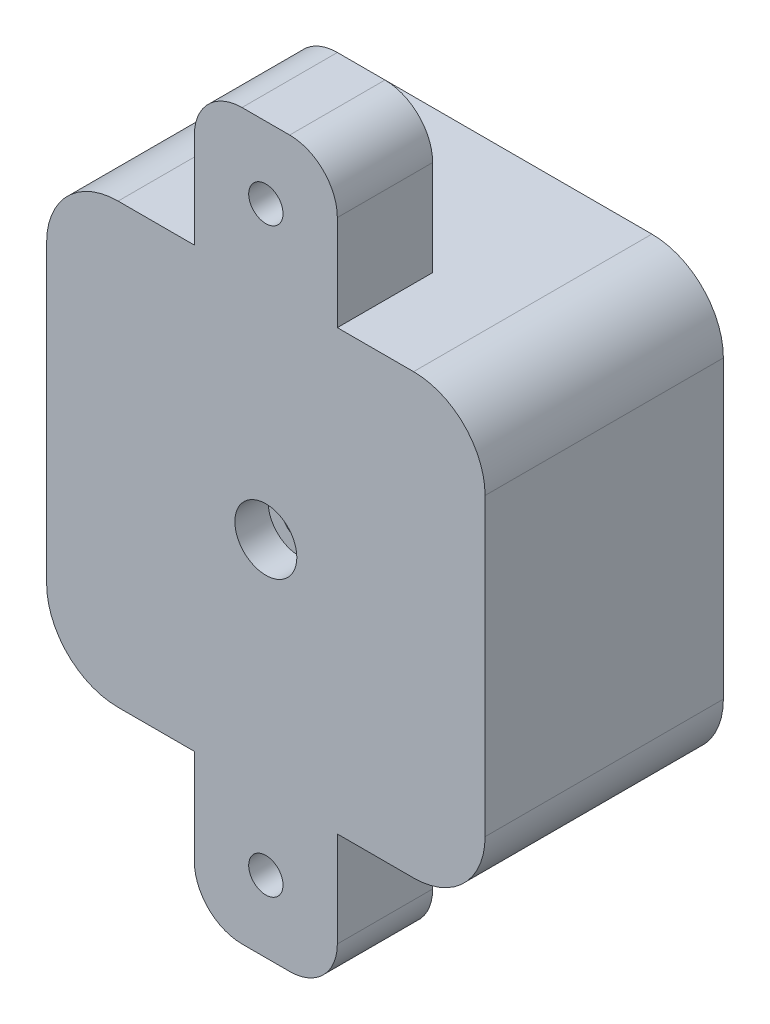
ISO-10303-21;
HEADER;
FILE_DESCRIPTION(('STEP AP214'),'2;1');
FILE_NAME('part.step','',(''),(''),'','','');
FILE_SCHEMA(('AUTOMOTIVE_DESIGN { 1 0 10303 214 1 1 1 1 }'));
ENDSEC;
DATA;
#1=APPLICATION_CONTEXT('core data for automotive mechanical design processes');
#2=APPLICATION_PROTOCOL_DEFINITION('international standard','automotive_design',2000,#1);
#3=PRODUCT_CONTEXT('',#1,'mechanical');
#4=PRODUCT('Part','Part','',(#3));
#5=PRODUCT_RELATED_PRODUCT_CATEGORY('part','',(#4));
#6=PRODUCT_DEFINITION_FORMATION('','',#4);
#7=PRODUCT_DEFINITION_CONTEXT('part definition',#1,'design');
#8=PRODUCT_DEFINITION('design','',#6,#7);
#9=PRODUCT_DEFINITION_SHAPE('','',#8);
#10=(LENGTH_UNIT() NAMED_UNIT(*) SI_UNIT(.MILLI.,.METRE.));
#11=(NAMED_UNIT(*) PLANE_ANGLE_UNIT() SI_UNIT($,.RADIAN.));
#12=(NAMED_UNIT(*) SI_UNIT($,.STERADIAN.) SOLID_ANGLE_UNIT());
#13=UNCERTAINTY_MEASURE_WITH_UNIT(LENGTH_MEASURE(1.E-05),#10,'distance_accuracy_value','');
#14=(GEOMETRIC_REPRESENTATION_CONTEXT(3) GLOBAL_UNCERTAINTY_ASSIGNED_CONTEXT((#13)) GLOBAL_UNIT_ASSIGNED_CONTEXT((#10,
#11,#12)) REPRESENTATION_CONTEXT('',''));
#15=CARTESIAN_POINT('',(0.,0.,0.));
#16=DIRECTION('',(0.,0.,1.));
#17=DIRECTION('',(1.,0.,0.));
#18=AXIS2_PLACEMENT_3D('',#15,#16,#17);
#19=CARTESIAN_POINT('',(0.,0.,25.));
#20=DIRECTION('',(0.,0.,1.));
#21=DIRECTION('',(1.,0.,0.));
#22=AXIS2_PLACEMENT_3D('',#19,#20,#21);
#23=CYLINDRICAL_SURFACE('',#22,1.79999999999999);
#24=CARTESIAN_POINT('',(0.,0.,17.));
#25=DIRECTION('',(0.,0.,-1.));
#26=DIRECTION('',(-1.,0.,0.));
#27=AXIS2_PLACEMENT_3D('',#24,#25,#26);
#28=CIRCLE('',#27,1.79999999999999);
#29=CARTESIAN_POINT('',(-1.79999999999999,0.,17.));
#30=VERTEX_POINT('',#29);
#31=EDGE_CURVE('E700',#30,#30,#28,.T.);
#32=ORIENTED_EDGE('',*,*,#31,.T.);
#33=EDGE_LOOP('',(#32));
#34=FACE_BOUND('',#33,.T.);
#35=CARTESIAN_POINT('',(0.,0.,21.5));
#36=DIRECTION('',(0.,0.,1.));
#37=DIRECTION('',(1.,0.,0.));
#38=AXIS2_PLACEMENT_3D('',#35,#36,#37);
#39=CIRCLE('',#38,1.79999999999999);
#40=CARTESIAN_POINT('',(1.79999999999999,0.,21.5));
#41=VERTEX_POINT('',#40);
#42=EDGE_CURVE('E37',#41,#41,#39,.F.);
#43=ORIENTED_EDGE('',*,*,#42,.F.);
#44=EDGE_LOOP('',(#43));
#45=FACE_BOUND('',#44,.T.);
#46=ADVANCED_FACE('F33',(#34,#45),#23,.F.);
#47=CARTESIAN_POINT('',(15.5,-15.5,25.));
#48=DIRECTION('',(0.,0.,-1.));
#49=DIRECTION('',(-1.,0.,0.));
#50=AXIS2_PLACEMENT_3D('',#47,#48,#49);
#51=CYLINDRICAL_SURFACE('',#50,7.5);
#52=CARTESIAN_POINT('',(15.5,-15.5,0.));
#53=DIRECTION('',(0.,0.,1.));
#54=DIRECTION('',(1.,0.,0.));
#55=AXIS2_PLACEMENT_3D('',#52,#53,#54);
#56=CIRCLE('',#55,7.5);
#57=CARTESIAN_POINT('',(15.5,-23.,0.));
#58=VERTEX_POINT('',#57);
#59=CARTESIAN_POINT('',(23.,-15.5,0.));
#60=VERTEX_POINT('',#59);
#61=EDGE_CURVE('E306',#58,#60,#56,.T.);
#62=ORIENTED_EDGE('',*,*,#61,.T.);
#63=DIRECTION('',(0.,0.,-1.));
#64=VECTOR('',#63,1.);
#65=CARTESIAN_POINT('',(23.,-15.5,25.));
#66=LINE('',#65,#64);
#67=CARTESIAN_POINT('',(23.,-15.5,25.));
#68=VERTEX_POINT('',#67);
#69=EDGE_CURVE('E11',#68,#60,#66,.T.);
#70=ORIENTED_EDGE('',*,*,#69,.F.);
#71=CARTESIAN_POINT('',(15.5,-15.5,25.));
#72=DIRECTION('',(0.,0.,1.));
#73=DIRECTION('',(1.,0.,0.));
#74=AXIS2_PLACEMENT_3D('',#71,#72,#73);
#75=CIRCLE('',#74,7.5);
#76=CARTESIAN_POINT('',(15.5,-23.,25.));
#77=VERTEX_POINT('',#76);
#78=EDGE_CURVE('E309',#77,#68,#75,.T.);
#79=ORIENTED_EDGE('',*,*,#78,.F.);
#80=DIRECTION('',(0.,0.,-1.));
#81=VECTOR('',#80,1.);
#82=CARTESIAN_POINT('',(15.5,-23.,25.));
#83=LINE('',#82,#81);
#84=EDGE_CURVE('E330',#77,#58,#83,.T.);
#85=ORIENTED_EDGE('',*,*,#84,.T.);
#86=EDGE_LOOP('',(#62,#70,#79,#85));
#87=FACE_BOUND('',#86,.T.);
#88=ADVANCED_FACE('F35',(#87),#51,.T.);
#89=CARTESIAN_POINT('',(23.,15.5,25.));
#90=DIRECTION('',(-1.,0.,0.));
#91=DIRECTION('',(0.,-1.,0.));
#92=AXIS2_PLACEMENT_3D('',#89,#90,#91);
#93=PLANE('',#92);
#94=DIRECTION('',(0.,1.,0.));
#95=VECTOR('',#94,1.);
#96=CARTESIAN_POINT('',(23.,15.5,0.));
#97=LINE('',#96,#95);
#98=CARTESIAN_POINT('',(23.,15.5,0.));
#99=VERTEX_POINT('',#98);
#100=EDGE_CURVE('E333',#60,#99,#97,.T.);
#101=ORIENTED_EDGE('',*,*,#100,.T.);
#102=DIRECTION('',(0.,0.,-1.));
#103=VECTOR('',#102,1.);
#104=CARTESIAN_POINT('',(23.,15.5,25.));
#105=LINE('',#104,#103);
#106=CARTESIAN_POINT('',(23.,15.5,25.));
#107=VERTEX_POINT('',#106);
#108=EDGE_CURVE('E42',#107,#99,#105,.T.);
#109=ORIENTED_EDGE('',*,*,#108,.F.);
#110=DIRECTION('',(0.,1.,0.));
#111=VECTOR('',#110,1.);
#112=CARTESIAN_POINT('',(23.,15.5,25.));
#113=LINE('',#112,#111);
#114=EDGE_CURVE('E312',#68,#107,#113,.T.);
#115=ORIENTED_EDGE('',*,*,#114,.F.);
#116=ORIENTED_EDGE('',*,*,#69,.T.);
#117=EDGE_LOOP('',(#101,#109,#115,#116));
#118=FACE_BOUND('',#117,.T.);
#119=ADVANCED_FACE('F421',(#118),#93,.F.);
#120=CARTESIAN_POINT('',(15.5,15.5,25.));
#121=DIRECTION('',(0.,0.,-1.));
#122=DIRECTION('',(-1.,0.,0.));
#123=AXIS2_PLACEMENT_3D('',#120,#121,#122);
#124=CYLINDRICAL_SURFACE('',#123,7.5);
#125=CARTESIAN_POINT('',(15.5,15.5,0.));
#126=DIRECTION('',(0.,0.,1.));
#127=DIRECTION('',(-1.,0.,0.));
#128=AXIS2_PLACEMENT_3D('',#125,#126,#127);
#129=CIRCLE('',#128,7.5);
#130=CARTESIAN_POINT('',(15.5,23.,0.));
#131=VERTEX_POINT('',#130);
#132=EDGE_CURVE('E335',#99,#131,#129,.T.);
#133=ORIENTED_EDGE('',*,*,#132,.T.);
#134=DIRECTION('',(0.,0.,-1.));
#135=VECTOR('',#134,1.);
#136=CARTESIAN_POINT('',(15.5,23.,25.));
#137=LINE('',#136,#135);
#138=CARTESIAN_POINT('',(15.5,23.,25.));
#139=VERTEX_POINT('',#138);
#140=EDGE_CURVE('E360',#139,#131,#137,.T.);
#141=ORIENTED_EDGE('',*,*,#140,.F.);
#142=CARTESIAN_POINT('',(15.5,15.5,25.));
#143=DIRECTION('',(0.,0.,1.));
#144=DIRECTION('',(-1.,0.,0.));
#145=AXIS2_PLACEMENT_3D('',#142,#143,#144);
#146=CIRCLE('',#145,7.5);
#147=EDGE_CURVE('E315',#107,#139,#146,.T.);
#148=ORIENTED_EDGE('',*,*,#147,.F.);
#149=ORIENTED_EDGE('',*,*,#108,.T.);
#150=EDGE_LOOP('',(#133,#141,#148,#149));
#151=FACE_BOUND('',#150,.T.);
#152=ADVANCED_FACE('F368',(#151),#124,.T.);
#153=CARTESIAN_POINT('',(-15.5,23.,25.));
#154=DIRECTION('',(0.,-1.,0.));
#155=DIRECTION('',(0.,0.,-1.));
#156=AXIS2_PLACEMENT_3D('',#153,#154,#155);
#157=PLANE('',#156);
#158=DIRECTION('',(-1.,0.,0.));
#159=VECTOR('',#158,1.);
#160=CARTESIAN_POINT('',(-15.5,23.,25.));
#161=LINE('',#160,#159);
#162=CARTESIAN_POINT('',(-7.50000000000001,23.,25.));
#163=VERTEX_POINT('',#162);
#164=CARTESIAN_POINT('',(-15.5,23.,25.));
#165=VERTEX_POINT('',#164);
#166=EDGE_CURVE('E219',#163,#165,#161,.T.);
#167=ORIENTED_EDGE('',*,*,#166,.F.);
#168=DIRECTION('',(0.,0.,1.));
#169=VECTOR('',#168,1.);
#170=CARTESIAN_POINT('',(-7.50000000000001,23.,15.));
#171=LINE('',#170,#169);
#172=CARTESIAN_POINT('',(-7.50000000000001,23.,15.));
#173=VERTEX_POINT('',#172);
#174=EDGE_CURVE('E212',#173,#163,#171,.T.);
#175=ORIENTED_EDGE('',*,*,#174,.F.);
#176=DIRECTION('',(1.,0.,0.));
#177=VECTOR('',#176,1.);
#178=CARTESIAN_POINT('',(-7.50000000000001,23.,15.));
#179=LINE('',#178,#177);
#180=CARTESIAN_POINT('',(7.49999999999999,23.,15.));
#181=VERTEX_POINT('',#180);
#182=EDGE_CURVE('E197',#173,#181,#179,.T.);
#183=ORIENTED_EDGE('',*,*,#182,.T.);
#184=DIRECTION('',(0.,0.,1.));
#185=VECTOR('',#184,1.);
#186=CARTESIAN_POINT('',(7.49999999999999,23.,15.));
#187=LINE('',#186,#185);
#188=CARTESIAN_POINT('',(7.49999999999999,23.,25.));
#189=VERTEX_POINT('',#188);
#190=EDGE_CURVE('E220',#181,#189,#187,.T.);
#191=ORIENTED_EDGE('',*,*,#190,.T.);
#192=EDGE_CURVE('E317',#139,#189,#161,.T.);
#193=ORIENTED_EDGE('',*,*,#192,.F.);
#194=ORIENTED_EDGE('',*,*,#140,.T.);
#195=DIRECTION('',(-1.,0.,0.));
#196=VECTOR('',#195,1.);
#197=CARTESIAN_POINT('',(-15.5,23.,0.));
#198=LINE('',#197,#196);
#199=CARTESIAN_POINT('',(-15.5,23.,0.));
#200=VERTEX_POINT('',#199);
#201=EDGE_CURVE('E337',#131,#200,#198,.T.);
#202=ORIENTED_EDGE('',*,*,#201,.T.);
#203=DIRECTION('',(0.,0.,-1.));
#204=VECTOR('',#203,1.);
#205=CARTESIAN_POINT('',(-15.5,23.,25.));
#206=LINE('',#205,#204);
#207=EDGE_CURVE('E357',#165,#200,#206,.T.);
#208=ORIENTED_EDGE('',*,*,#207,.F.);
#209=EDGE_LOOP('',(#167,#175,#183,#191,#193,#194,#202,#208));
#210=FACE_BOUND('',#209,.T.);
#211=ADVANCED_FACE('F217',(#210),#157,.F.);
#212=CARTESIAN_POINT('',(-15.5,15.5,25.));
#213=DIRECTION('',(0.,0.,-1.));
#214=DIRECTION('',(-1.,0.,0.));
#215=AXIS2_PLACEMENT_3D('',#212,#213,#214);
#216=CYLINDRICAL_SURFACE('',#215,7.5);
#217=CARTESIAN_POINT('',(-15.5,15.5,0.));
#218=DIRECTION('',(0.,0.,1.));
#219=DIRECTION('',(1.,0.,0.));
#220=AXIS2_PLACEMENT_3D('',#217,#218,#219);
#221=CIRCLE('',#220,7.5);
#222=CARTESIAN_POINT('',(-23.,15.5,0.));
#223=VERTEX_POINT('',#222);
#224=EDGE_CURVE('E339',#200,#223,#221,.T.);
#225=ORIENTED_EDGE('',*,*,#224,.T.);
#226=DIRECTION('',(0.,0.,-1.));
#227=VECTOR('',#226,1.);
#228=CARTESIAN_POINT('',(-23.,15.5,25.));
#229=LINE('',#228,#227);
#230=CARTESIAN_POINT('',(-23.,15.5,25.));
#231=VERTEX_POINT('',#230);
#232=EDGE_CURVE('E354',#231,#223,#229,.T.);
#233=ORIENTED_EDGE('',*,*,#232,.F.);
#234=CARTESIAN_POINT('',(-15.5,15.5,25.));
#235=DIRECTION('',(0.,0.,1.));
#236=DIRECTION('',(1.,0.,0.));
#237=AXIS2_PLACEMENT_3D('',#234,#235,#236);
#238=CIRCLE('',#237,7.5);
#239=EDGE_CURVE('E320',#165,#231,#238,.T.);
#240=ORIENTED_EDGE('',*,*,#239,.F.);
#241=ORIENTED_EDGE('',*,*,#207,.T.);
#242=EDGE_LOOP('',(#225,#233,#240,#241));
#243=FACE_BOUND('',#242,.T.);
#244=ADVANCED_FACE('F380',(#243),#216,.T.);
#245=CARTESIAN_POINT('',(-23.,15.5,25.));
#246=DIRECTION('',(1.,0.,0.));
#247=DIRECTION('',(0.,1.,0.));
#248=AXIS2_PLACEMENT_3D('',#245,#246,#247);
#249=PLANE('',#248);
#250=DIRECTION('',(0.,-1.,0.));
#251=VECTOR('',#250,1.);
#252=CARTESIAN_POINT('',(-23.,-15.,8.));
#253=LINE('',#252,#251);
#254=CARTESIAN_POINT('',(-23.,15.,8.));
#255=VERTEX_POINT('',#254);
#256=CARTESIAN_POINT('',(-23.,-15.,8.));
#257=VERTEX_POINT('',#256);
#258=EDGE_CURVE('E277',#255,#257,#253,.T.);
#259=ORIENTED_EDGE('',*,*,#258,.F.);
#260=DIRECTION('',(0.,0.,-1.));
#261=VECTOR('',#260,1.);
#262=CARTESIAN_POINT('',(-23.,15.,18.));
#263=LINE('',#262,#261);
#264=CARTESIAN_POINT('',(-23.,15.,18.));
#265=VERTEX_POINT('',#264);
#266=EDGE_CURVE('E280',#265,#255,#263,.T.);
#267=ORIENTED_EDGE('',*,*,#266,.F.);
#268=DIRECTION('',(0.,1.,0.));
#269=VECTOR('',#268,1.);
#270=CARTESIAN_POINT('',(-23.,-15.,18.));
#271=LINE('',#270,#269);
#272=CARTESIAN_POINT('',(-23.,-15.,18.));
#273=VERTEX_POINT('',#272);
#274=EDGE_CURVE('E283',#273,#265,#271,.T.);
#275=ORIENTED_EDGE('',*,*,#274,.F.);
#276=DIRECTION('',(0.,0.,1.));
#277=VECTOR('',#276,1.);
#278=CARTESIAN_POINT('',(-23.,-15.,18.));
#279=LINE('',#278,#277);
#280=EDGE_CURVE('E274',#257,#273,#279,.T.);
#281=ORIENTED_EDGE('',*,*,#280,.F.);
#282=EDGE_LOOP('',(#259,#267,#275,#281));
#283=FACE_BOUND('',#282,.T.);
#284=DIRECTION('',(0.,-1.,0.));
#285=VECTOR('',#284,1.);
#286=CARTESIAN_POINT('',(-23.,15.5,0.));
#287=LINE('',#286,#285);
#288=CARTESIAN_POINT('',(-23.,-15.5,0.));
#289=VERTEX_POINT('',#288);
#290=EDGE_CURVE('E341',#223,#289,#287,.T.);
#291=ORIENTED_EDGE('',*,*,#290,.T.);
#292=DIRECTION('',(0.,0.,-1.));
#293=VECTOR('',#292,1.);
#294=CARTESIAN_POINT('',(-23.,-15.5,25.));
#295=LINE('',#294,#293);
#296=CARTESIAN_POINT('',(-23.,-15.5,25.));
#297=VERTEX_POINT('',#296);
#298=EDGE_CURVE('E351',#297,#289,#295,.T.);
#299=ORIENTED_EDGE('',*,*,#298,.F.);
#300=DIRECTION('',(0.,-1.,0.));
#301=VECTOR('',#300,1.);
#302=CARTESIAN_POINT('',(-23.,15.5,25.));
#303=LINE('',#302,#301);
#304=EDGE_CURVE('E322',#231,#297,#303,.T.);
#305=ORIENTED_EDGE('',*,*,#304,.F.);
#306=ORIENTED_EDGE('',*,*,#232,.T.);
#307=EDGE_LOOP('',(#291,#299,#305,#306));
#308=FACE_BOUND('',#307,.T.);
#309=ADVANCED_FACE('F388',(#283,#308),#249,.F.);
#310=CARTESIAN_POINT('',(-15.5,-15.5,25.));
#311=DIRECTION('',(0.,0.,-1.));
#312=DIRECTION('',(-1.,0.,0.));
#313=AXIS2_PLACEMENT_3D('',#310,#311,#312);
#314=CYLINDRICAL_SURFACE('',#313,7.5);
#315=CARTESIAN_POINT('',(-15.5,-15.5,0.));
#316=DIRECTION('',(0.,0.,1.));
#317=DIRECTION('',(1.,0.,0.));
#318=AXIS2_PLACEMENT_3D('',#315,#316,#317);
#319=CIRCLE('',#318,7.5);
#320=CARTESIAN_POINT('',(-15.5,-23.,0.));
#321=VERTEX_POINT('',#320);
#322=EDGE_CURVE('E343',#289,#321,#319,.T.);
#323=ORIENTED_EDGE('',*,*,#322,.T.);
#324=DIRECTION('',(0.,0.,-1.));
#325=VECTOR('',#324,1.);
#326=CARTESIAN_POINT('',(-15.5,-23.,25.));
#327=LINE('',#326,#325);
#328=CARTESIAN_POINT('',(-15.5,-23.,25.));
#329=VERTEX_POINT('',#328);
#330=EDGE_CURVE('E348',#329,#321,#327,.T.);
#331=ORIENTED_EDGE('',*,*,#330,.F.);
#332=CARTESIAN_POINT('',(-15.5,-15.5,25.));
#333=DIRECTION('',(0.,0.,1.));
#334=DIRECTION('',(1.,0.,0.));
#335=AXIS2_PLACEMENT_3D('',#332,#333,#334);
#336=CIRCLE('',#335,7.5);
#337=EDGE_CURVE('E324',#297,#329,#336,.T.);
#338=ORIENTED_EDGE('',*,*,#337,.F.);
#339=ORIENTED_EDGE('',*,*,#298,.T.);
#340=EDGE_LOOP('',(#323,#331,#338,#339));
#341=FACE_BOUND('',#340,.T.);
#342=ADVANCED_FACE('F391',(#341),#314,.T.);
#343=CARTESIAN_POINT('',(-15.5,-23.,25.));
#344=DIRECTION('',(0.,1.,0.));
#345=DIRECTION('',(0.,0.,1.));
#346=AXIS2_PLACEMENT_3D('',#343,#344,#345);
#347=PLANE('',#346);
#348=DIRECTION('',(-1.,0.,0.));
#349=VECTOR('',#348,1.);
#350=CARTESIAN_POINT('',(-7.5,-23.,15.));
#351=LINE('',#350,#349);
#352=CARTESIAN_POINT('',(7.50000000000001,-23.,15.));
#353=VERTEX_POINT('',#352);
#354=CARTESIAN_POINT('',(-7.5,-23.,15.));
#355=VERTEX_POINT('',#354);
#356=EDGE_CURVE('E243',#353,#355,#351,.T.);
#357=ORIENTED_EDGE('',*,*,#356,.T.);
#358=DIRECTION('',(0.,0.,1.));
#359=VECTOR('',#358,1.);
#360=CARTESIAN_POINT('',(-7.5,-23.,15.));
#361=LINE('',#360,#359);
#362=CARTESIAN_POINT('',(-7.5,-23.,25.));
#363=VERTEX_POINT('',#362);
#364=EDGE_CURVE('E259',#355,#363,#361,.T.);
#365=ORIENTED_EDGE('',*,*,#364,.T.);
#366=DIRECTION('',(1.,0.,0.));
#367=VECTOR('',#366,1.);
#368=CARTESIAN_POINT('',(-15.5,-23.,25.));
#369=LINE('',#368,#367);
#370=EDGE_CURVE('E327',#329,#363,#369,.T.);
#371=ORIENTED_EDGE('',*,*,#370,.F.);
#372=ORIENTED_EDGE('',*,*,#330,.T.);
#373=DIRECTION('',(1.,0.,0.));
#374=VECTOR('',#373,1.);
#375=CARTESIAN_POINT('',(-15.5,-23.,0.));
#376=LINE('',#375,#374);
#377=EDGE_CURVE('E313',#321,#58,#376,.T.);
#378=ORIENTED_EDGE('',*,*,#377,.T.);
#379=ORIENTED_EDGE('',*,*,#84,.F.);
#380=CARTESIAN_POINT('',(7.5,-23.,25.));
#381=VERTEX_POINT('',#380);
#382=EDGE_CURVE('E326',#381,#77,#369,.T.);
#383=ORIENTED_EDGE('',*,*,#382,.F.);
#384=DIRECTION('',(0.,0.,1.));
#385=VECTOR('',#384,1.);
#386=CARTESIAN_POINT('',(7.50000000000001,-23.,15.));
#387=LINE('',#386,#385);
#388=EDGE_CURVE('E263',#353,#381,#387,.T.);
#389=ORIENTED_EDGE('',*,*,#388,.F.);
#390=EDGE_LOOP('',(#357,#365,#371,#372,#378,#379,#383,#389));
#391=FACE_BOUND('',#390,.T.);
#392=ADVANCED_FACE('F395',(#391),#347,.F.);
#393=CARTESIAN_POINT('',(15.5,-15.5,25.));
#394=DIRECTION('',(0.,0.,1.));
#395=DIRECTION('',(1.,0.,0.));
#396=AXIS2_PLACEMENT_3D('',#393,#394,#395);
#397=PLANE('',#396);
#398=CARTESIAN_POINT('',(0.,0.,25.));
#399=DIRECTION('',(0.,0.,1.));
#400=DIRECTION('',(1.,0.,0.));
#401=AXIS2_PLACEMENT_3D('',#398,#399,#400);
#402=CIRCLE('',#401,3.25);
#403=CARTESIAN_POINT('',(3.25,0.,25.));
#404=VERTEX_POINT('',#403);
#405=EDGE_CURVE('E684',#404,#404,#402,.T.);
#406=ORIENTED_EDGE('',*,*,#405,.F.);
#407=EDGE_LOOP('',(#406));
#408=FACE_BOUND('',#407,.T.);
#409=CARTESIAN_POINT('',(0.,30.5,25.));
#410=DIRECTION('',(0.,0.,1.));
#411=DIRECTION('',(1.,0.,0.));
#412=AXIS2_PLACEMENT_3D('',#409,#410,#411);
#413=CIRCLE('',#412,1.79999999999999);
#414=CARTESIAN_POINT('',(1.79999999999997,30.5,25.));
#415=VERTEX_POINT('',#414);
#416=EDGE_CURVE('E688',#415,#415,#413,.T.);
#417=ORIENTED_EDGE('',*,*,#416,.F.);
#418=EDGE_LOOP('',(#417));
#419=FACE_BOUND('',#418,.T.);
#420=CARTESIAN_POINT('',(0.,-30.5,25.));
#421=DIRECTION('',(0.,0.,1.));
#422=DIRECTION('',(1.,0.,0.));
#423=AXIS2_PLACEMENT_3D('',#420,#421,#422);
#424=CIRCLE('',#423,1.79999999999999);
#425=CARTESIAN_POINT('',(1.79999999999999,-30.5,25.));
#426=VERTEX_POINT('',#425);
#427=EDGE_CURVE('E694',#426,#426,#424,.T.);
#428=ORIENTED_EDGE('',*,*,#427,.F.);
#429=EDGE_LOOP('',(#428));
#430=FACE_BOUND('',#429,.T.);
#431=ORIENTED_EDGE('',*,*,#78,.T.);
#432=ORIENTED_EDGE('',*,*,#114,.T.);
#433=ORIENTED_EDGE('',*,*,#147,.T.);
#434=ORIENTED_EDGE('',*,*,#192,.T.);
#435=DIRECTION('',(0.,1.,0.));
#436=VECTOR('',#435,1.);
#437=CARTESIAN_POINT('',(7.49999999999999,23.,25.));
#438=LINE('',#437,#436);
#439=CARTESIAN_POINT('',(7.49999999999999,33.,25.));
#440=VERTEX_POINT('',#439);
#441=EDGE_CURVE('E715',#189,#440,#438,.T.);
#442=ORIENTED_EDGE('',*,*,#441,.T.);
#443=CARTESIAN_POINT('',(2.49999999999999,33.,25.));
#444=DIRECTION('',(0.,0.,1.));
#445=DIRECTION('',(1.,0.,0.));
#446=AXIS2_PLACEMENT_3D('',#443,#444,#445);
#447=CIRCLE('',#446,5.);
#448=CARTESIAN_POINT('',(2.49999999999995,38.,25.));
#449=VERTEX_POINT('',#448);
#450=EDGE_CURVE('E718',#440,#449,#447,.T.);
#451=ORIENTED_EDGE('',*,*,#450,.T.);
#452=DIRECTION('',(-1.,0.,0.));
#453=VECTOR('',#452,1.);
#454=CARTESIAN_POINT('',(-2.49999999999998,38.,25.));
#455=LINE('',#454,#453);
#456=CARTESIAN_POINT('',(-2.49999999999998,38.,25.));
#457=VERTEX_POINT('',#456);
#458=EDGE_CURVE('E721',#449,#457,#455,.T.);
#459=ORIENTED_EDGE('',*,*,#458,.T.);
#460=CARTESIAN_POINT('',(-2.50000000000001,33.,25.));
#461=DIRECTION('',(0.,0.,1.));
#462=DIRECTION('',(1.,0.,0.));
#463=AXIS2_PLACEMENT_3D('',#460,#461,#462);
#464=CIRCLE('',#463,5.);
#465=CARTESIAN_POINT('',(-7.50000000000001,33.,25.));
#466=VERTEX_POINT('',#465);
#467=EDGE_CURVE('E215',#457,#466,#464,.T.);
#468=ORIENTED_EDGE('',*,*,#467,.T.);
#469=DIRECTION('',(0.,-1.,0.));
#470=VECTOR('',#469,1.);
#471=CARTESIAN_POINT('',(-7.50000000000001,23.,25.));
#472=LINE('',#471,#470);
#473=EDGE_CURVE('E49',#466,#163,#472,.T.);
#474=ORIENTED_EDGE('',*,*,#473,.T.);
#475=ORIENTED_EDGE('',*,*,#166,.T.);
#476=ORIENTED_EDGE('',*,*,#239,.T.);
#477=ORIENTED_EDGE('',*,*,#304,.T.);
#478=ORIENTED_EDGE('',*,*,#337,.T.);
#479=ORIENTED_EDGE('',*,*,#370,.T.);
#480=DIRECTION('',(0.,-1.,0.));
#481=VECTOR('',#480,1.);
#482=CARTESIAN_POINT('',(-7.5,-23.,25.));
#483=LINE('',#482,#481);
#484=CARTESIAN_POINT('',(-7.5,-33.,25.));
#485=VERTEX_POINT('',#484);
#486=EDGE_CURVE('E247',#363,#485,#483,.T.);
#487=ORIENTED_EDGE('',*,*,#486,.T.);
#488=CARTESIAN_POINT('',(-2.49999999999999,-33.,25.));
#489=DIRECTION('',(0.,0.,1.));
#490=DIRECTION('',(1.,0.,0.));
#491=AXIS2_PLACEMENT_3D('',#488,#489,#490);
#492=CIRCLE('',#491,5.);
#493=CARTESIAN_POINT('',(-2.49999999999996,-38.,25.));
#494=VERTEX_POINT('',#493);
#495=EDGE_CURVE('E250',#485,#494,#492,.T.);
#496=ORIENTED_EDGE('',*,*,#495,.T.);
#497=DIRECTION('',(1.,0.,0.));
#498=VECTOR('',#497,1.);
#499=CARTESIAN_POINT('',(-2.49999999999996,-38.,25.));
#500=LINE('',#499,#498);
#501=CARTESIAN_POINT('',(2.49999999999997,-38.,25.));
#502=VERTEX_POINT('',#501);
#503=EDGE_CURVE('E253',#494,#502,#500,.T.);
#504=ORIENTED_EDGE('',*,*,#503,.T.);
#505=CARTESIAN_POINT('',(2.50000000000001,-33.,25.));
#506=DIRECTION('',(0.,0.,1.));
#507=DIRECTION('',(1.,0.,0.));
#508=AXIS2_PLACEMENT_3D('',#505,#506,#507);
#509=CIRCLE('',#508,5.);
#510=CARTESIAN_POINT('',(7.50000000000001,-33.,25.));
#511=VERTEX_POINT('',#510);
#512=EDGE_CURVE('E256',#502,#511,#509,.T.);
#513=ORIENTED_EDGE('',*,*,#512,.T.);
#514=DIRECTION('',(0.,1.,0.));
#515=VECTOR('',#514,1.);
#516=CARTESIAN_POINT('',(7.50000000000001,-23.,25.));
#517=LINE('',#516,#515);
#518=EDGE_CURVE('E56',#511,#381,#517,.T.);
#519=ORIENTED_EDGE('',*,*,#518,.T.);
#520=ORIENTED_EDGE('',*,*,#382,.T.);
#521=EDGE_LOOP('',(#431,#432,#433,#434,#442,#451,#459,#468,#474,#475,#476,#477,#478,#479,#487,
#496,#504,#513,#519,#520));
#522=FACE_BOUND('',#521,.T.);
#523=ADVANCED_FACE('F383',(#408,#419,#430,#522),#397,.T.);
#524=CARTESIAN_POINT('',(15.5,-15.5,0.));
#525=DIRECTION('',(0.,0.,1.));
#526=DIRECTION('',(1.,0.,0.));
#527=AXIS2_PLACEMENT_3D('',#524,#525,#526);
#528=PLANE('',#527);
#529=CARTESIAN_POINT('',(0.,0.,0.));
#530=DIRECTION('',(0.,0.,-1.));
#531=DIRECTION('',(-1.,0.,0.));
#532=AXIS2_PLACEMENT_3D('',#529,#530,#531);
#533=CIRCLE('',#532,20.);
#534=CARTESIAN_POINT('',(-20.,0.,0.));
#535=VERTEX_POINT('',#534);
#536=EDGE_CURVE('E298',#535,#535,#533,.T.);
#537=ORIENTED_EDGE('',*,*,#536,.F.);
#538=EDGE_LOOP('',(#537));
#539=FACE_BOUND('',#538,.T.);
#540=ORIENTED_EDGE('',*,*,#61,.F.);
#541=ORIENTED_EDGE('',*,*,#377,.F.);
#542=ORIENTED_EDGE('',*,*,#322,.F.);
#543=ORIENTED_EDGE('',*,*,#290,.F.);
#544=ORIENTED_EDGE('',*,*,#224,.F.);
#545=ORIENTED_EDGE('',*,*,#201,.F.);
#546=ORIENTED_EDGE('',*,*,#132,.F.);
#547=ORIENTED_EDGE('',*,*,#100,.F.);
#548=EDGE_LOOP('',(#540,#541,#542,#543,#544,#545,#546,#547));
#549=FACE_BOUND('',#548,.T.);
#550=ADVANCED_FACE('F374',(#539,#549),#528,.F.);
#551=CARTESIAN_POINT('',(0.,0.,21.));
#552=DIRECTION('',(0.,0.,-1.));
#553=DIRECTION('',(-1.,0.,0.));
#554=AXIS2_PLACEMENT_3D('',#551,#552,#553);
#555=CYLINDRICAL_SURFACE('',#554,20.);
#556=CARTESIAN_POINT('',(0.,0.,18.));
#557=DIRECTION('',(0.,0.,1.));
#558=DIRECTION('',(1.,0.,0.));
#559=AXIS2_PLACEMENT_3D('',#556,#557,#558);
#560=CIRCLE('',#559,20.);
#561=CARTESIAN_POINT('',(-13.228756555323,15.,18.));
#562=VERTEX_POINT('',#561);
#563=CARTESIAN_POINT('',(-13.228756555323,-15.,18.));
#564=VERTEX_POINT('',#563);
#565=EDGE_CURVE('E273',#562,#564,#560,.T.);
#566=ORIENTED_EDGE('',*,*,#565,.F.);
#567=DIRECTION('',(0.,0.,-1.));
#568=VECTOR('',#567,1.);
#569=CARTESIAN_POINT('',(-13.228756555323,15.,21.));
#570=LINE('',#569,#568);
#571=CARTESIAN_POINT('',(-13.2287565553229,15.,8.));
#572=VERTEX_POINT('',#571);
#573=EDGE_CURVE('E262',#572,#562,#570,.F.);
#574=ORIENTED_EDGE('',*,*,#573,.F.);
#575=CARTESIAN_POINT('',(0.,0.,8.));
#576=DIRECTION('',(0.,0.,-1.));
#577=DIRECTION('',(-1.,0.,0.));
#578=AXIS2_PLACEMENT_3D('',#575,#576,#577);
#579=CIRCLE('',#578,20.);
#580=CARTESIAN_POINT('',(-13.228756555323,-15.,8.));
#581=VERTEX_POINT('',#580);
#582=EDGE_CURVE('E286',#581,#572,#579,.T.);
#583=ORIENTED_EDGE('',*,*,#582,.F.);
#584=DIRECTION('',(0.,0.,-1.));
#585=VECTOR('',#584,1.);
#586=CARTESIAN_POINT('',(-13.228756555323,-15.,21.));
#587=LINE('',#586,#585);
#588=EDGE_CURVE('E287',#564,#581,#587,.T.);
#589=ORIENTED_EDGE('',*,*,#588,.F.);
#590=EDGE_LOOP('',(#566,#574,#583,#589));
#591=FACE_BOUND('',#590,.T.);
#592=CARTESIAN_POINT('',(0.,0.,21.));
#593=DIRECTION('',(0.,0.,-1.));
#594=DIRECTION('',(-1.,0.,0.));
#595=AXIS2_PLACEMENT_3D('',#592,#593,#594);
#596=CIRCLE('',#595,20.);
#597=CARTESIAN_POINT('',(-20.,0.,21.));
#598=VERTEX_POINT('',#597);
#599=EDGE_CURVE('E303',#598,#598,#596,.T.);
#600=ORIENTED_EDGE('',*,*,#599,.F.);
#601=EDGE_LOOP('',(#600));
#602=FACE_BOUND('',#601,.T.);
#603=ORIENTED_EDGE('',*,*,#536,.T.);
#604=EDGE_LOOP('',(#603));
#605=FACE_BOUND('',#604,.T.);
#606=ADVANCED_FACE('F503',(#591,#602,#605),#555,.F.);
#607=CARTESIAN_POINT('',(0.,0.,21.));
#608=DIRECTION('',(0.,0.,-1.));
#609=DIRECTION('',(-1.,0.,0.));
#610=AXIS2_PLACEMENT_3D('',#607,#608,#609);
#611=PLANE('',#610);
#612=CARTESIAN_POINT('',(0.,0.,21.));
#613=DIRECTION('',(0.,0.,-1.));
#614=DIRECTION('',(-1.,0.,0.));
#615=AXIS2_PLACEMENT_3D('',#612,#613,#614);
#616=CIRCLE('',#615,3.5);
#617=CARTESIAN_POINT('',(-3.5,0.,21.));
#618=VERTEX_POINT('',#617);
#619=EDGE_CURVE('E702',#618,#618,#616,.T.);
#620=ORIENTED_EDGE('',*,*,#619,.F.);
#621=EDGE_LOOP('',(#620));
#622=FACE_BOUND('',#621,.T.);
#623=ORIENTED_EDGE('',*,*,#599,.T.);
#624=EDGE_LOOP('',(#623));
#625=FACE_BOUND('',#624,.T.);
#626=ADVANCED_FACE('F496',(#622,#625),#611,.T.);
#627=CARTESIAN_POINT('',(23.001,15.,18.));
#628=DIRECTION('',(0.,1.,0.));
#629=DIRECTION('',(-1.,0.,0.));
#630=AXIS2_PLACEMENT_3D('',#627,#628,#629);
#631=PLANE('',#630);
#632=ORIENTED_EDGE('',*,*,#573,.T.);
#633=DIRECTION('',(-1.,0.,0.));
#634=VECTOR('',#633,1.);
#635=CARTESIAN_POINT('',(23.001,15.,18.));
#636=LINE('',#635,#634);
#637=EDGE_CURVE('E293',#562,#265,#636,.T.);
#638=ORIENTED_EDGE('',*,*,#637,.T.);
#639=ORIENTED_EDGE('',*,*,#266,.T.);
#640=DIRECTION('',(-1.,0.,0.));
#641=VECTOR('',#640,1.);
#642=CARTESIAN_POINT('',(23.001,15.,8.));
#643=LINE('',#642,#641);
#644=EDGE_CURVE('E276',#572,#255,#643,.T.);
#645=ORIENTED_EDGE('',*,*,#644,.F.);
#646=EDGE_LOOP('',(#632,#638,#639,#645));
#647=FACE_BOUND('',#646,.T.);
#648=ADVANCED_FACE('F492',(#647),#631,.F.);
#649=CARTESIAN_POINT('',(23.001,-15.,8.));
#650=DIRECTION('',(0.,0.,-1.));
#651=DIRECTION('',(-1.,0.,0.));
#652=AXIS2_PLACEMENT_3D('',#649,#650,#651);
#653=PLANE('',#652);
#654=ORIENTED_EDGE('',*,*,#582,.T.);
#655=ORIENTED_EDGE('',*,*,#644,.T.);
#656=ORIENTED_EDGE('',*,*,#258,.T.);
#657=DIRECTION('',(-1.,0.,0.));
#658=VECTOR('',#657,1.);
#659=CARTESIAN_POINT('',(23.001,-15.,8.));
#660=LINE('',#659,#658);
#661=EDGE_CURVE('E294',#581,#257,#660,.T.);
#662=ORIENTED_EDGE('',*,*,#661,.F.);
#663=EDGE_LOOP('',(#654,#655,#656,#662));
#664=FACE_BOUND('',#663,.T.);
#665=ADVANCED_FACE('F488',(#664),#653,.F.);
#666=CARTESIAN_POINT('',(23.001,-15.,18.));
#667=DIRECTION('',(0.,-1.,0.));
#668=DIRECTION('',(0.,0.,-1.));
#669=AXIS2_PLACEMENT_3D('',#666,#667,#668);
#670=PLANE('',#669);
#671=ORIENTED_EDGE('',*,*,#588,.T.);
#672=ORIENTED_EDGE('',*,*,#661,.T.);
#673=ORIENTED_EDGE('',*,*,#280,.T.);
#674=DIRECTION('',(-1.,0.,0.));
#675=VECTOR('',#674,1.);
#676=CARTESIAN_POINT('',(23.001,-15.,18.));
#677=LINE('',#676,#675);
#678=EDGE_CURVE('E290',#564,#273,#677,.T.);
#679=ORIENTED_EDGE('',*,*,#678,.F.);
#680=EDGE_LOOP('',(#671,#672,#673,#679));
#681=FACE_BOUND('',#680,.T.);
#682=ADVANCED_FACE('F485',(#681),#670,.F.);
#683=CARTESIAN_POINT('',(23.001,-15.,18.));
#684=DIRECTION('',(0.,0.,1.));
#685=DIRECTION('',(1.,0.,0.));
#686=AXIS2_PLACEMENT_3D('',#683,#684,#685);
#687=PLANE('',#686);
#688=ORIENTED_EDGE('',*,*,#565,.T.);
#689=ORIENTED_EDGE('',*,*,#678,.T.);
#690=ORIENTED_EDGE('',*,*,#274,.T.);
#691=ORIENTED_EDGE('',*,*,#637,.F.);
#692=EDGE_LOOP('',(#688,#689,#690,#691));
#693=FACE_BOUND('',#692,.T.);
#694=ADVANCED_FACE('F484',(#693),#687,.F.);
#695=CARTESIAN_POINT('',(-7.5,-23.,15.));
#696=DIRECTION('',(-1.,0.,0.));
#697=DIRECTION('',(0.,-1.,0.));
#698=AXIS2_PLACEMENT_3D('',#695,#696,#697);
#699=PLANE('',#698);
#700=ORIENTED_EDGE('',*,*,#486,.F.);
#701=ORIENTED_EDGE('',*,*,#364,.F.);
#702=DIRECTION('',(0.,-1.,0.));
#703=VECTOR('',#702,1.);
#704=CARTESIAN_POINT('',(-7.5,-23.,15.));
#705=LINE('',#704,#703);
#706=CARTESIAN_POINT('',(-7.5,-33.,15.));
#707=VERTEX_POINT('',#706);
#708=EDGE_CURVE('E229',#355,#707,#705,.T.);
#709=ORIENTED_EDGE('',*,*,#708,.T.);
#710=DIRECTION('',(0.,0.,1.));
#711=VECTOR('',#710,1.);
#712=CARTESIAN_POINT('',(-7.5,-33.,15.));
#713=LINE('',#712,#711);
#714=EDGE_CURVE('E246',#707,#485,#713,.T.);
#715=ORIENTED_EDGE('',*,*,#714,.T.);
#716=EDGE_LOOP('',(#700,#701,#709,#715));
#717=FACE_BOUND('',#716,.T.);
#718=ADVANCED_FACE('F398',(#717),#699,.T.);
#719=CARTESIAN_POINT('',(7.50000000000001,-23.,15.));
#720=DIRECTION('',(1.,0.,0.));
#721=DIRECTION('',(0.,1.,0.));
#722=AXIS2_PLACEMENT_3D('',#719,#720,#721);
#723=PLANE('',#722);
#724=ORIENTED_EDGE('',*,*,#518,.F.);
#725=DIRECTION('',(0.,0.,1.));
#726=VECTOR('',#725,1.);
#727=CARTESIAN_POINT('',(7.50000000000001,-33.,15.));
#728=LINE('',#727,#726);
#729=CARTESIAN_POINT('',(7.50000000000001,-33.,15.));
#730=VERTEX_POINT('',#729);
#731=EDGE_CURVE('E265',#730,#511,#728,.T.);
#732=ORIENTED_EDGE('',*,*,#731,.F.);
#733=DIRECTION('',(0.,1.,0.));
#734=VECTOR('',#733,1.);
#735=CARTESIAN_POINT('',(7.50000000000001,-23.,15.));
#736=LINE('',#735,#734);
#737=EDGE_CURVE('E241',#730,#353,#736,.T.);
#738=ORIENTED_EDGE('',*,*,#737,.T.);
#739=ORIENTED_EDGE('',*,*,#388,.T.);
#740=EDGE_LOOP('',(#724,#732,#738,#739));
#741=FACE_BOUND('',#740,.T.);
#742=ADVANCED_FACE('F413',(#741),#723,.T.);
#743=CARTESIAN_POINT('',(2.50000000000001,-33.,15.));
#744=DIRECTION('',(0.,0.,1.));
#745=DIRECTION('',(1.,0.,0.));
#746=AXIS2_PLACEMENT_3D('',#743,#744,#745);
#747=CYLINDRICAL_SURFACE('',#746,5.);
#748=ORIENTED_EDGE('',*,*,#512,.F.);
#749=DIRECTION('',(0.,0.,1.));
#750=VECTOR('',#749,1.);
#751=CARTESIAN_POINT('',(2.49999999999997,-38.,15.));
#752=LINE('',#751,#750);
#753=CARTESIAN_POINT('',(2.49999999999997,-38.,15.));
#754=VERTEX_POINT('',#753);
#755=EDGE_CURVE('E267',#754,#502,#752,.T.);
#756=ORIENTED_EDGE('',*,*,#755,.F.);
#757=CARTESIAN_POINT('',(2.50000000000001,-33.,15.));
#758=DIRECTION('',(0.,0.,1.));
#759=DIRECTION('',(1.,0.,0.));
#760=AXIS2_PLACEMENT_3D('',#757,#758,#759);
#761=CIRCLE('',#760,5.);
#762=EDGE_CURVE('E238',#754,#730,#761,.T.);
#763=ORIENTED_EDGE('',*,*,#762,.T.);
#764=ORIENTED_EDGE('',*,*,#731,.T.);
#765=EDGE_LOOP('',(#748,#756,#763,#764));
#766=FACE_BOUND('',#765,.T.);
#767=ADVANCED_FACE('F409',(#766),#747,.T.);
#768=CARTESIAN_POINT('',(-2.49999999999996,-38.,15.));
#769=DIRECTION('',(0.,-1.,0.));
#770=DIRECTION('',(0.,0.,-1.));
#771=AXIS2_PLACEMENT_3D('',#768,#769,#770);
#772=PLANE('',#771);
#773=ORIENTED_EDGE('',*,*,#503,.F.);
#774=DIRECTION('',(0.,0.,1.));
#775=VECTOR('',#774,1.);
#776=CARTESIAN_POINT('',(-2.49999999999996,-38.,15.));
#777=LINE('',#776,#775);
#778=CARTESIAN_POINT('',(-2.49999999999996,-38.,15.));
#779=VERTEX_POINT('',#778);
#780=EDGE_CURVE('E269',#779,#494,#777,.T.);
#781=ORIENTED_EDGE('',*,*,#780,.F.);
#782=DIRECTION('',(1.,0.,0.));
#783=VECTOR('',#782,1.);
#784=CARTESIAN_POINT('',(-2.49999999999996,-38.,15.));
#785=LINE('',#784,#783);
#786=EDGE_CURVE('E235',#779,#754,#785,.T.);
#787=ORIENTED_EDGE('',*,*,#786,.T.);
#788=ORIENTED_EDGE('',*,*,#755,.T.);
#789=EDGE_LOOP('',(#773,#781,#787,#788));
#790=FACE_BOUND('',#789,.T.);
#791=ADVANCED_FACE('F406',(#790),#772,.T.);
#792=CARTESIAN_POINT('',(-2.49999999999999,-33.,15.));
#793=DIRECTION('',(0.,0.,1.));
#794=DIRECTION('',(1.,0.,0.));
#795=AXIS2_PLACEMENT_3D('',#792,#793,#794);
#796=CYLINDRICAL_SURFACE('',#795,5.);
#797=ORIENTED_EDGE('',*,*,#495,.F.);
#798=ORIENTED_EDGE('',*,*,#714,.F.);
#799=CARTESIAN_POINT('',(-2.49999999999999,-33.,15.));
#800=DIRECTION('',(0.,0.,1.));
#801=DIRECTION('',(1.,0.,0.));
#802=AXIS2_PLACEMENT_3D('',#799,#800,#801);
#803=CIRCLE('',#802,5.);
#804=EDGE_CURVE('E232',#707,#779,#803,.T.);
#805=ORIENTED_EDGE('',*,*,#804,.T.);
#806=ORIENTED_EDGE('',*,*,#780,.T.);
#807=EDGE_LOOP('',(#797,#798,#805,#806));
#808=FACE_BOUND('',#807,.T.);
#809=ADVANCED_FACE('F402',(#808),#796,.T.);
#810=CARTESIAN_POINT('',(-2.49999999999999,-33.,15.));
#811=DIRECTION('',(0.,0.,1.));
#812=DIRECTION('',(1.,0.,0.));
#813=AXIS2_PLACEMENT_3D('',#810,#811,#812);
#814=PLANE('',#813);
#815=CARTESIAN_POINT('',(0.,-30.5,15.));
#816=DIRECTION('',(0.,0.,1.));
#817=DIRECTION('',(1.,0.,0.));
#818=AXIS2_PLACEMENT_3D('',#815,#816,#817);
#819=CIRCLE('',#818,1.79999999999999);
#820=CARTESIAN_POINT('',(1.79999999999999,-30.5,15.));
#821=VERTEX_POINT('',#820);
#822=EDGE_CURVE('E697',#821,#821,#819,.T.);
#823=ORIENTED_EDGE('',*,*,#822,.T.);
#824=EDGE_LOOP('',(#823));
#825=FACE_BOUND('',#824,.T.);
#826=ORIENTED_EDGE('',*,*,#708,.F.);
#827=ORIENTED_EDGE('',*,*,#356,.F.);
#828=ORIENTED_EDGE('',*,*,#737,.F.);
#829=ORIENTED_EDGE('',*,*,#762,.F.);
#830=ORIENTED_EDGE('',*,*,#786,.F.);
#831=ORIENTED_EDGE('',*,*,#804,.F.);
#832=EDGE_LOOP('',(#826,#827,#828,#829,#830,#831));
#833=FACE_BOUND('',#832,.T.);
#834=ADVANCED_FACE('F470',(#825,#833),#814,.F.);
#835=CARTESIAN_POINT('',(-7.50000000000001,23.,15.));
#836=DIRECTION('',(-1.,0.,0.));
#837=DIRECTION('',(0.,-1.,0.));
#838=AXIS2_PLACEMENT_3D('',#835,#836,#837);
#839=PLANE('',#838);
#840=ORIENTED_EDGE('',*,*,#473,.F.);
#841=DIRECTION('',(0.,0.,1.));
#842=VECTOR('',#841,1.);
#843=CARTESIAN_POINT('',(-7.50000000000001,33.,15.));
#844=LINE('',#843,#842);
#845=CARTESIAN_POINT('',(-7.50000000000001,33.,15.));
#846=VERTEX_POINT('',#845);
#847=EDGE_CURVE('E214',#846,#466,#844,.T.);
#848=ORIENTED_EDGE('',*,*,#847,.F.);
#849=DIRECTION('',(0.,-1.,0.));
#850=VECTOR('',#849,1.);
#851=CARTESIAN_POINT('',(-7.50000000000001,23.,15.));
#852=LINE('',#851,#850);
#853=EDGE_CURVE('E201',#846,#173,#852,.T.);
#854=ORIENTED_EDGE('',*,*,#853,.T.);
#855=ORIENTED_EDGE('',*,*,#174,.T.);
#856=EDGE_LOOP('',(#840,#848,#854,#855));
#857=FACE_BOUND('',#856,.T.);
#858=ADVANCED_FACE('F211',(#857),#839,.T.);
#859=CARTESIAN_POINT('',(-2.50000000000001,33.,15.));
#860=DIRECTION('',(0.,0.,1.));
#861=DIRECTION('',(1.,0.,0.));
#862=AXIS2_PLACEMENT_3D('',#859,#860,#861);
#863=CYLINDRICAL_SURFACE('',#862,5.);
#864=ORIENTED_EDGE('',*,*,#467,.F.);
#865=DIRECTION('',(0.,0.,1.));
#866=VECTOR('',#865,1.);
#867=CARTESIAN_POINT('',(-2.49999999999998,38.,15.));
#868=LINE('',#867,#866);
#869=CARTESIAN_POINT('',(-2.49999999999998,38.,15.));
#870=VERTEX_POINT('',#869);
#871=EDGE_CURVE('E726',#870,#457,#868,.T.);
#872=ORIENTED_EDGE('',*,*,#871,.F.);
#873=CARTESIAN_POINT('',(-2.50000000000001,33.,15.));
#874=DIRECTION('',(0.,0.,1.));
#875=DIRECTION('',(1.,0.,0.));
#876=AXIS2_PLACEMENT_3D('',#873,#874,#875);
#877=CIRCLE('',#876,5.);
#878=EDGE_CURVE('E221',#870,#846,#877,.T.);
#879=ORIENTED_EDGE('',*,*,#878,.T.);
#880=ORIENTED_EDGE('',*,*,#847,.T.);
#881=EDGE_LOOP('',(#864,#872,#879,#880));
#882=FACE_BOUND('',#881,.T.);
#883=ADVANCED_FACE('F453',(#882),#863,.T.);
#884=CARTESIAN_POINT('',(-2.49999999999998,38.,15.));
#885=DIRECTION('',(0.,1.,0.));
#886=DIRECTION('',(0.,0.,1.));
#887=AXIS2_PLACEMENT_3D('',#884,#885,#886);
#888=PLANE('',#887);
#889=ORIENTED_EDGE('',*,*,#458,.F.);
#890=DIRECTION('',(0.,0.,1.));
#891=VECTOR('',#890,1.);
#892=CARTESIAN_POINT('',(2.49999999999995,38.,15.));
#893=LINE('',#892,#891);
#894=CARTESIAN_POINT('',(2.49999999999995,38.,15.));
#895=VERTEX_POINT('',#894);
#896=EDGE_CURVE('E728',#895,#449,#893,.T.);
#897=ORIENTED_EDGE('',*,*,#896,.F.);
#898=DIRECTION('',(-1.,0.,0.));
#899=VECTOR('',#898,1.);
#900=CARTESIAN_POINT('',(-2.49999999999998,38.,15.));
#901=LINE('',#900,#899);
#902=EDGE_CURVE('E225',#895,#870,#901,.T.);
#903=ORIENTED_EDGE('',*,*,#902,.T.);
#904=ORIENTED_EDGE('',*,*,#871,.T.);
#905=EDGE_LOOP('',(#889,#897,#903,#904));
#906=FACE_BOUND('',#905,.T.);
#907=ADVANCED_FACE('F456',(#906),#888,.T.);
#908=CARTESIAN_POINT('',(2.49999999999999,33.,15.));
#909=DIRECTION('',(0.,0.,1.));
#910=DIRECTION('',(1.,0.,0.));
#911=AXIS2_PLACEMENT_3D('',#908,#909,#910);
#912=CYLINDRICAL_SURFACE('',#911,5.);
#913=ORIENTED_EDGE('',*,*,#450,.F.);
#914=DIRECTION('',(0.,0.,1.));
#915=VECTOR('',#914,1.);
#916=CARTESIAN_POINT('',(7.49999999999999,33.,15.));
#917=LINE('',#916,#915);
#918=CARTESIAN_POINT('',(7.49999999999999,33.,15.));
#919=VERTEX_POINT('',#918);
#920=EDGE_CURVE('E223',#919,#440,#917,.T.);
#921=ORIENTED_EDGE('',*,*,#920,.F.);
#922=CARTESIAN_POINT('',(2.49999999999999,33.,15.));
#923=DIRECTION('',(0.,0.,1.));
#924=DIRECTION('',(1.,0.,0.));
#925=AXIS2_PLACEMENT_3D('',#922,#923,#924);
#926=CIRCLE('',#925,5.);
#927=EDGE_CURVE('E709',#919,#895,#926,.T.);
#928=ORIENTED_EDGE('',*,*,#927,.T.);
#929=ORIENTED_EDGE('',*,*,#896,.T.);
#930=EDGE_LOOP('',(#913,#921,#928,#929));
#931=FACE_BOUND('',#930,.T.);
#932=ADVANCED_FACE('F460',(#931),#912,.T.);
#933=CARTESIAN_POINT('',(7.49999999999999,23.,15.));
#934=DIRECTION('',(1.,0.,0.));
#935=DIRECTION('',(0.,1.,0.));
#936=AXIS2_PLACEMENT_3D('',#933,#934,#935);
#937=PLANE('',#936);
#938=ORIENTED_EDGE('',*,*,#441,.F.);
#939=ORIENTED_EDGE('',*,*,#190,.F.);
#940=DIRECTION('',(0.,1.,0.));
#941=VECTOR('',#940,1.);
#942=CARTESIAN_POINT('',(7.49999999999999,23.,15.));
#943=LINE('',#942,#941);
#944=EDGE_CURVE('E205',#181,#919,#943,.T.);
#945=ORIENTED_EDGE('',*,*,#944,.T.);
#946=ORIENTED_EDGE('',*,*,#920,.T.);
#947=EDGE_LOOP('',(#938,#939,#945,#946));
#948=FACE_BOUND('',#947,.T.);
#949=ADVANCED_FACE('F451',(#948),#937,.T.);
#950=CARTESIAN_POINT('',(-2.50000000000001,33.,15.));
#951=DIRECTION('',(0.,0.,1.));
#952=DIRECTION('',(1.,0.,0.));
#953=AXIS2_PLACEMENT_3D('',#950,#951,#952);
#954=PLANE('',#953);
#955=CARTESIAN_POINT('',(0.,30.5,15.));
#956=DIRECTION('',(0.,0.,1.));
#957=DIRECTION('',(1.,0.,0.));
#958=AXIS2_PLACEMENT_3D('',#955,#956,#957);
#959=CIRCLE('',#958,1.79999999999999);
#960=CARTESIAN_POINT('',(1.79999999999998,30.5,15.));
#961=VERTEX_POINT('',#960);
#962=EDGE_CURVE('E691',#961,#961,#959,.T.);
#963=ORIENTED_EDGE('',*,*,#962,.T.);
#964=EDGE_LOOP('',(#963));
#965=FACE_BOUND('',#964,.T.);
#966=ORIENTED_EDGE('',*,*,#853,.F.);
#967=ORIENTED_EDGE('',*,*,#878,.F.);
#968=ORIENTED_EDGE('',*,*,#902,.F.);
#969=ORIENTED_EDGE('',*,*,#927,.F.);
#970=ORIENTED_EDGE('',*,*,#944,.F.);
#971=ORIENTED_EDGE('',*,*,#182,.F.);
#972=EDGE_LOOP('',(#966,#967,#968,#969,#970,#971));
#973=FACE_BOUND('',#972,.T.);
#974=ADVANCED_FACE('F199',(#965,#973),#954,.F.);
#975=CARTESIAN_POINT('',(0.,0.,17.));
#976=DIRECTION('',(0.,0.,1.));
#977=DIRECTION('',(1.,0.,0.));
#978=AXIS2_PLACEMENT_3D('',#975,#976,#977);
#979=CYLINDRICAL_SURFACE('',#978,3.5);
#980=CARTESIAN_POINT('',(0.,0.,17.));
#981=DIRECTION('',(0.,0.,-1.));
#982=DIRECTION('',(-1.,0.,0.));
#983=AXIS2_PLACEMENT_3D('',#980,#981,#982);
#984=CIRCLE('',#983,3.5);
#985=CARTESIAN_POINT('',(-3.5,0.,17.));
#986=VERTEX_POINT('',#985);
#987=EDGE_CURVE('E703',#986,#986,#984,.T.);
#988=ORIENTED_EDGE('',*,*,#987,.F.);
#989=EDGE_LOOP('',(#988));
#990=FACE_BOUND('',#989,.T.);
#991=ORIENTED_EDGE('',*,*,#619,.T.);
#992=EDGE_LOOP('',(#991));
#993=FACE_BOUND('',#992,.T.);
#994=ADVANCED_FACE('F444',(#990,#993),#979,.T.);
#995=CARTESIAN_POINT('',(0.,0.,17.));
#996=DIRECTION('',(0.,0.,-1.));
#997=DIRECTION('',(-1.,0.,0.));
#998=AXIS2_PLACEMENT_3D('',#995,#996,#997);
#999=PLANE('',#998);
#1000=ORIENTED_EDGE('',*,*,#31,.F.);
#1001=EDGE_LOOP('',(#1000));
#1002=FACE_BOUND('',#1001,.T.);
#1003=ORIENTED_EDGE('',*,*,#987,.T.);
#1004=EDGE_LOOP('',(#1003));
#1005=FACE_BOUND('',#1004,.T.);
#1006=ADVANCED_FACE('F441',(#1002,#1005),#999,.T.);
#1007=CARTESIAN_POINT('',(0.,-30.5,25.));
#1008=DIRECTION('',(0.,0.,1.));
#1009=DIRECTION('',(1.,0.,0.));
#1010=AXIS2_PLACEMENT_3D('',#1007,#1008,#1009);
#1011=CYLINDRICAL_SURFACE('',#1010,1.79999999999999);
#1012=ORIENTED_EDGE('',*,*,#822,.F.);
#1013=EDGE_LOOP('',(#1012));
#1014=FACE_BOUND('',#1013,.T.);
#1015=ORIENTED_EDGE('',*,*,#427,.T.);
#1016=EDGE_LOOP('',(#1015));
#1017=FACE_BOUND('',#1016,.T.);
#1018=ADVANCED_FACE('F439',(#1014,#1017),#1011,.F.);
#1019=CARTESIAN_POINT('',(0.,30.5,25.));
#1020=DIRECTION('',(0.,0.,1.));
#1021=DIRECTION('',(1.,0.,0.));
#1022=AXIS2_PLACEMENT_3D('',#1019,#1020,#1021);
#1023=CYLINDRICAL_SURFACE('',#1022,1.79999999999999);
#1024=ORIENTED_EDGE('',*,*,#962,.F.);
#1025=EDGE_LOOP('',(#1024));
#1026=FACE_BOUND('',#1025,.T.);
#1027=ORIENTED_EDGE('',*,*,#416,.T.);
#1028=EDGE_LOOP('',(#1027));
#1029=FACE_BOUND('',#1028,.T.);
#1030=ADVANCED_FACE('F647',(#1026,#1029),#1023,.F.);
#1031=CARTESIAN_POINT('',(0.,0.,21.5));
#1032=DIRECTION('',(0.,0.,1.));
#1033=DIRECTION('',(1.,0.,0.));
#1034=AXIS2_PLACEMENT_3D('',#1031,#1032,#1033);
#1035=PLANE('',#1034);
#1036=CARTESIAN_POINT('',(0.,0.,21.5));
#1037=DIRECTION('',(0.,0.,1.));
#1038=DIRECTION('',(1.,0.,0.));
#1039=AXIS2_PLACEMENT_3D('',#1036,#1037,#1038);
#1040=CIRCLE('',#1039,3.25);
#1041=CARTESIAN_POINT('',(3.25,0.,21.5));
#1042=VERTEX_POINT('',#1041);
#1043=EDGE_CURVE('E681',#1042,#1042,#1040,.T.);
#1044=ORIENTED_EDGE('',*,*,#1043,.T.);
#1045=EDGE_LOOP('',(#1044));
#1046=FACE_BOUND('',#1045,.T.);
#1047=ORIENTED_EDGE('',*,*,#42,.T.);
#1048=EDGE_LOOP('',(#1047));
#1049=FACE_BOUND('',#1048,.T.);
#1050=ADVANCED_FACE('F653',(#1046,#1049),#1035,.T.);
#1051=CARTESIAN_POINT('',(0.,0.,21.5));
#1052=DIRECTION('',(0.,0.,1.));
#1053=DIRECTION('',(1.,0.,0.));
#1054=AXIS2_PLACEMENT_3D('',#1051,#1052,#1053);
#1055=CYLINDRICAL_SURFACE('',#1054,3.25);
#1056=ORIENTED_EDGE('',*,*,#1043,.F.);
#1057=EDGE_LOOP('',(#1056));
#1058=FACE_BOUND('',#1057,.T.);
#1059=ORIENTED_EDGE('',*,*,#405,.T.);
#1060=EDGE_LOOP('',(#1059));
#1061=FACE_BOUND('',#1060,.T.);
#1062=ADVANCED_FACE('F664',(#1058,#1061),#1055,.F.);
#1063=CLOSED_SHELL('',(#46,#88,#119,#152,#211,#244,#309,#342,#392,#523,#550,#606,#626,#648,#665,
#682,#694,#718,#742,#767,#791,#809,#834,#858,#883,#907,#932,#949,#974,#994,#1006,#1018,#1030,
#1050,#1062));
#1064=MANIFOLD_SOLID_BREP('B2',#1063);
#1065=ADVANCED_BREP_SHAPE_REPRESENTATION('',(#18,#1064),#14);
#1066=SHAPE_DEFINITION_REPRESENTATION(#9,#1065);
ENDSEC;
END-ISO-10303-21;
